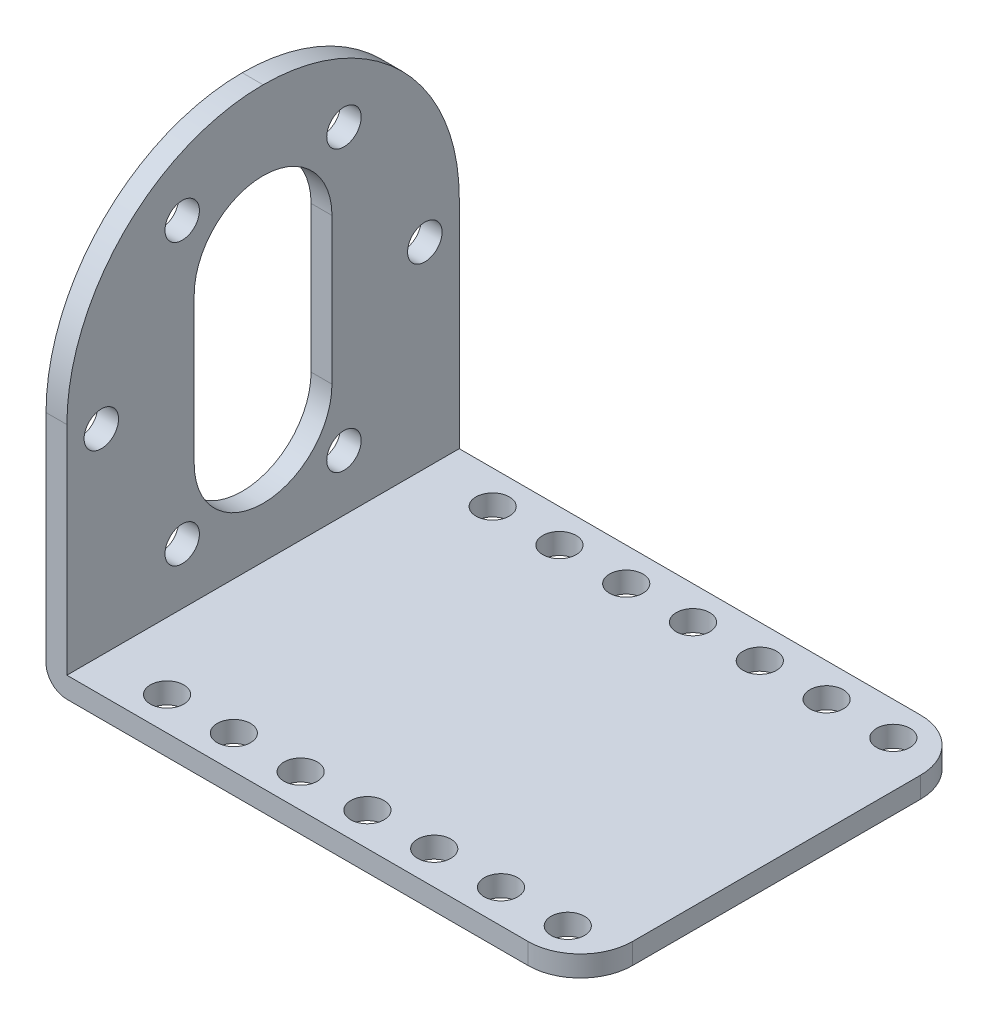
ISO-10303-21;
HEADER;
FILE_DESCRIPTION(('STEP AP214'),'2;1');
FILE_NAME('part.step','',(''),(''),'','','');
FILE_SCHEMA(('AUTOMOTIVE_DESIGN { 1 0 10303 214 1 1 1 1 }'));
ENDSEC;
DATA;
#1=APPLICATION_CONTEXT('core data for automotive mechanical design processes');
#2=APPLICATION_PROTOCOL_DEFINITION('international standard','automotive_design',2000,#1);
#3=PRODUCT_CONTEXT('',#1,'mechanical');
#4=PRODUCT('Part','Part','',(#3));
#5=PRODUCT_RELATED_PRODUCT_CATEGORY('part','',(#4));
#6=PRODUCT_DEFINITION_FORMATION('','',#4);
#7=PRODUCT_DEFINITION_CONTEXT('part definition',#1,'design');
#8=PRODUCT_DEFINITION('design','',#6,#7);
#9=PRODUCT_DEFINITION_SHAPE('','',#8);
#10=(LENGTH_UNIT() NAMED_UNIT(*) SI_UNIT(.MILLI.,.METRE.));
#11=(NAMED_UNIT(*) PLANE_ANGLE_UNIT() SI_UNIT($,.RADIAN.));
#12=(NAMED_UNIT(*) SI_UNIT($,.STERADIAN.) SOLID_ANGLE_UNIT());
#13=UNCERTAINTY_MEASURE_WITH_UNIT(LENGTH_MEASURE(1.E-05),#10,'distance_accuracy_value','');
#14=(GEOMETRIC_REPRESENTATION_CONTEXT(3) GLOBAL_UNCERTAINTY_ASSIGNED_CONTEXT((#13)) GLOBAL_UNIT_ASSIGNED_CONTEXT((#10,
#11,#12)) REPRESENTATION_CONTEXT('',''));
#15=CARTESIAN_POINT('',(0.,0.,0.));
#16=DIRECTION('',(0.,0.,1.));
#17=DIRECTION('',(1.,0.,0.));
#18=AXIS2_PLACEMENT_3D('',#15,#16,#17);
#19=CARTESIAN_POINT('',(0.,2.,0.));
#20=DIRECTION('',(0.,1.,0.));
#21=DIRECTION('',(0.,0.,1.));
#22=AXIS2_PLACEMENT_3D('',#19,#20,#21);
#23=PLANE('',#22);
#24=DIRECTION('',(0.,0.,-1.));
#25=VECTOR('',#24,1.);
#26=CARTESIAN_POINT('',(-23.6,2.,-18.8));
#27=LINE('',#26,#25);
#28=CARTESIAN_POINT('',(-23.6,2.,18.8));
#29=VERTEX_POINT('',#28);
#30=CARTESIAN_POINT('',(-23.6,2.,-18.8));
#31=VERTEX_POINT('',#30);
#32=EDGE_CURVE('E272',#29,#31,#27,.T.);
#33=ORIENTED_EDGE('',*,*,#32,.F.);
#34=DIRECTION('',(1.,0.,0.));
#35=VECTOR('',#34,1.);
#36=CARTESIAN_POINT('',(-25.6,2.,18.8));
#37=LINE('',#36,#35);
#38=CARTESIAN_POINT('',(20.6,2.,18.8));
#39=VERTEX_POINT('',#38);
#40=EDGE_CURVE('E325',#29,#39,#37,.T.);
#41=ORIENTED_EDGE('',*,*,#40,.T.);
#42=CARTESIAN_POINT('',(20.6,2.,13.8));
#43=DIRECTION('',(0.,1.,0.));
#44=DIRECTION('',(0.,0.,1.));
#45=AXIS2_PLACEMENT_3D('',#42,#43,#44);
#46=CIRCLE('',#45,5.);
#47=CARTESIAN_POINT('',(25.6,2.,13.8));
#48=VERTEX_POINT('',#47);
#49=EDGE_CURVE('E347',#39,#48,#46,.T.);
#50=ORIENTED_EDGE('',*,*,#49,.T.);
#51=DIRECTION('',(0.,0.,-1.));
#52=VECTOR('',#51,1.);
#53=CARTESIAN_POINT('',(25.6,2.,-18.8));
#54=LINE('',#53,#52);
#55=CARTESIAN_POINT('',(25.6,2.,-13.8));
#56=VERTEX_POINT('',#55);
#57=EDGE_CURVE('E362',#48,#56,#54,.T.);
#58=ORIENTED_EDGE('',*,*,#57,.T.);
#59=CARTESIAN_POINT('',(20.6,2.,-13.8));
#60=DIRECTION('',(0.,1.,0.));
#61=DIRECTION('',(0.,0.,1.));
#62=AXIS2_PLACEMENT_3D('',#59,#60,#61);
#63=CIRCLE('',#62,5.);
#64=CARTESIAN_POINT('',(20.6,2.,-18.8));
#65=VERTEX_POINT('',#64);
#66=EDGE_CURVE('E345',#56,#65,#63,.T.);
#67=ORIENTED_EDGE('',*,*,#66,.T.);
#68=DIRECTION('',(-1.,0.,0.));
#69=VECTOR('',#68,1.);
#70=CARTESIAN_POINT('',(-25.6,2.,-18.8));
#71=LINE('',#70,#69);
#72=EDGE_CURVE('E282',#65,#31,#71,.T.);
#73=ORIENTED_EDGE('',*,*,#72,.T.);
#74=EDGE_LOOP('',(#33,#41,#50,#58,#67,#73));
#75=FACE_BOUND('',#74,.T.);
#76=CARTESIAN_POINT('',(-10.8,2.,15.6));
#77=DIRECTION('',(0.,1.,0.));
#78=DIRECTION('',(0.,0.,-1.));
#79=AXIS2_PLACEMENT_3D('',#76,#77,#78);
#80=CIRCLE('',#79,1.6);
#81=CARTESIAN_POINT('',(-10.8,2.,14.));
#82=VERTEX_POINT('',#81);
#83=EDGE_CURVE('E438',#82,#82,#80,.T.);
#84=ORIENTED_EDGE('',*,*,#83,.F.);
#85=EDGE_LOOP('',(#84));
#86=FACE_BOUND('',#85,.T.);
#87=CARTESIAN_POINT('',(1.99999999999999,2.,15.6));
#88=DIRECTION('',(0.,1.,0.));
#89=DIRECTION('',(0.,0.,-1.));
#90=AXIS2_PLACEMENT_3D('',#87,#88,#89);
#91=CIRCLE('',#90,1.6);
#92=CARTESIAN_POINT('',(1.99999999999999,2.,14.));
#93=VERTEX_POINT('',#92);
#94=EDGE_CURVE('E426',#93,#93,#91,.T.);
#95=ORIENTED_EDGE('',*,*,#94,.F.);
#96=EDGE_LOOP('',(#95));
#97=FACE_BOUND('',#96,.T.);
#98=CARTESIAN_POINT('',(14.8,2.,15.6));
#99=DIRECTION('',(0.,1.,0.));
#100=DIRECTION('',(0.,0.,-1.));
#101=AXIS2_PLACEMENT_3D('',#98,#99,#100);
#102=CIRCLE('',#101,1.6);
#103=CARTESIAN_POINT('',(14.8,2.,14.));
#104=VERTEX_POINT('',#103);
#105=EDGE_CURVE('E414',#104,#104,#102,.T.);
#106=ORIENTED_EDGE('',*,*,#105,.F.);
#107=EDGE_LOOP('',(#106));
#108=FACE_BOUND('',#107,.T.);
#109=CARTESIAN_POINT('',(21.2,2.,-15.6));
#110=DIRECTION('',(0.,1.,0.));
#111=DIRECTION('',(0.,0.,1.));
#112=AXIS2_PLACEMENT_3D('',#109,#110,#111);
#113=CIRCLE('',#112,1.6);
#114=CARTESIAN_POINT('',(21.2,2.,-14.));
#115=VERTEX_POINT('',#114);
#116=EDGE_CURVE('E402',#115,#115,#113,.T.);
#117=ORIENTED_EDGE('',*,*,#116,.F.);
#118=EDGE_LOOP('',(#117));
#119=FACE_BOUND('',#118,.T.);
#120=CARTESIAN_POINT('',(8.4,2.,-15.6));
#121=DIRECTION('',(0.,1.,0.));
#122=DIRECTION('',(0.,0.,1.));
#123=AXIS2_PLACEMENT_3D('',#120,#121,#122);
#124=CIRCLE('',#123,1.6);
#125=CARTESIAN_POINT('',(8.4,2.,-14.));
#126=VERTEX_POINT('',#125);
#127=EDGE_CURVE('E390',#126,#126,#124,.T.);
#128=ORIENTED_EDGE('',*,*,#127,.F.);
#129=EDGE_LOOP('',(#128));
#130=FACE_BOUND('',#129,.T.);
#131=CARTESIAN_POINT('',(-4.4,2.,-15.6));
#132=DIRECTION('',(0.,1.,0.));
#133=DIRECTION('',(0.,0.,1.));
#134=AXIS2_PLACEMENT_3D('',#131,#132,#133);
#135=CIRCLE('',#134,1.6);
#136=CARTESIAN_POINT('',(-4.4,2.,-14.));
#137=VERTEX_POINT('',#136);
#138=EDGE_CURVE('E378',#137,#137,#135,.T.);
#139=ORIENTED_EDGE('',*,*,#138,.F.);
#140=EDGE_LOOP('',(#139));
#141=FACE_BOUND('',#140,.T.);
#142=CARTESIAN_POINT('',(-17.2,2.,-15.6));
#143=DIRECTION('',(0.,1.,0.));
#144=DIRECTION('',(0.,0.,1.));
#145=AXIS2_PLACEMENT_3D('',#142,#143,#144);
#146=CIRCLE('',#145,1.6);
#147=CARTESIAN_POINT('',(-17.2,2.,-14.));
#148=VERTEX_POINT('',#147);
#149=EDGE_CURVE('E360',#148,#148,#146,.T.);
#150=ORIENTED_EDGE('',*,*,#149,.F.);
#151=EDGE_LOOP('',(#150));
#152=FACE_BOUND('',#151,.T.);
#153=CARTESIAN_POINT('',(-10.8,2.,-15.6));
#154=DIRECTION('',(0.,1.,0.));
#155=DIRECTION('',(0.,0.,1.));
#156=AXIS2_PLACEMENT_3D('',#153,#154,#155);
#157=CIRCLE('',#156,1.6);
#158=CARTESIAN_POINT('',(-10.8,2.,-14.));
#159=VERTEX_POINT('',#158);
#160=EDGE_CURVE('E372',#159,#159,#157,.T.);
#161=ORIENTED_EDGE('',*,*,#160,.F.);
#162=EDGE_LOOP('',(#161));
#163=FACE_BOUND('',#162,.T.);
#164=CARTESIAN_POINT('',(1.99999999999999,2.,-15.6));
#165=DIRECTION('',(0.,1.,0.));
#166=DIRECTION('',(0.,0.,1.));
#167=AXIS2_PLACEMENT_3D('',#164,#165,#166);
#168=CIRCLE('',#167,1.6);
#169=CARTESIAN_POINT('',(1.99999999999999,2.,-14.));
#170=VERTEX_POINT('',#169);
#171=EDGE_CURVE('E384',#170,#170,#168,.T.);
#172=ORIENTED_EDGE('',*,*,#171,.F.);
#173=EDGE_LOOP('',(#172));
#174=FACE_BOUND('',#173,.T.);
#175=CARTESIAN_POINT('',(14.8,2.,-15.6));
#176=DIRECTION('',(0.,1.,0.));
#177=DIRECTION('',(0.,0.,1.));
#178=AXIS2_PLACEMENT_3D('',#175,#176,#177);
#179=CIRCLE('',#178,1.6);
#180=CARTESIAN_POINT('',(14.8,2.,-14.));
#181=VERTEX_POINT('',#180);
#182=EDGE_CURVE('E396',#181,#181,#179,.T.);
#183=ORIENTED_EDGE('',*,*,#182,.F.);
#184=EDGE_LOOP('',(#183));
#185=FACE_BOUND('',#184,.T.);
#186=CARTESIAN_POINT('',(21.2,2.,15.6));
#187=DIRECTION('',(0.,1.,0.));
#188=DIRECTION('',(0.,0.,-1.));
#189=AXIS2_PLACEMENT_3D('',#186,#187,#188);
#190=CIRCLE('',#189,1.6);
#191=CARTESIAN_POINT('',(21.2,2.,14.));
#192=VERTEX_POINT('',#191);
#193=EDGE_CURVE('E408',#192,#192,#190,.T.);
#194=ORIENTED_EDGE('',*,*,#193,.F.);
#195=EDGE_LOOP('',(#194));
#196=FACE_BOUND('',#195,.T.);
#197=CARTESIAN_POINT('',(8.4,2.,15.6));
#198=DIRECTION('',(0.,1.,0.));
#199=DIRECTION('',(0.,0.,-1.));
#200=AXIS2_PLACEMENT_3D('',#197,#198,#199);
#201=CIRCLE('',#200,1.6);
#202=CARTESIAN_POINT('',(8.4,2.,14.));
#203=VERTEX_POINT('',#202);
#204=EDGE_CURVE('E420',#203,#203,#201,.T.);
#205=ORIENTED_EDGE('',*,*,#204,.F.);
#206=EDGE_LOOP('',(#205));
#207=FACE_BOUND('',#206,.T.);
#208=CARTESIAN_POINT('',(-4.4,2.,15.6));
#209=DIRECTION('',(0.,1.,0.));
#210=DIRECTION('',(0.,0.,-1.));
#211=AXIS2_PLACEMENT_3D('',#208,#209,#210);
#212=CIRCLE('',#211,1.6);
#213=CARTESIAN_POINT('',(-4.4,2.,14.));
#214=VERTEX_POINT('',#213);
#215=EDGE_CURVE('E432',#214,#214,#212,.T.);
#216=ORIENTED_EDGE('',*,*,#215,.F.);
#217=EDGE_LOOP('',(#216));
#218=FACE_BOUND('',#217,.T.);
#219=CARTESIAN_POINT('',(-17.2,2.,15.6));
#220=DIRECTION('',(0.,1.,0.));
#221=DIRECTION('',(0.,0.,-1.));
#222=AXIS2_PLACEMENT_3D('',#219,#220,#221);
#223=CIRCLE('',#222,1.6);
#224=CARTESIAN_POINT('',(-17.2,2.,14.));
#225=VERTEX_POINT('',#224);
#226=EDGE_CURVE('E275',#225,#225,#223,.T.);
#227=ORIENTED_EDGE('',*,*,#226,.F.);
#228=EDGE_LOOP('',(#227));
#229=FACE_BOUND('',#228,.T.);
#230=ADVANCED_FACE('F93',(#75,#86,#97,#108,#119,#130,#141,#152,#163,#174,#185,#196,#207,#218,
#229),#23,.T.);
#231=CARTESIAN_POINT('',(0.,0.,0.));
#232=DIRECTION('',(0.,1.,0.));
#233=DIRECTION('',(0.,0.,1.));
#234=AXIS2_PLACEMENT_3D('',#231,#232,#233);
#235=PLANE('',#234);
#236=CARTESIAN_POINT('',(-10.8,0.,15.6));
#237=DIRECTION('',(0.,1.,0.));
#238=DIRECTION('',(0.,0.,-1.));
#239=AXIS2_PLACEMENT_3D('',#236,#237,#238);
#240=CIRCLE('',#239,1.6);
#241=CARTESIAN_POINT('',(-10.8,0.,14.));
#242=VERTEX_POINT('',#241);
#243=EDGE_CURVE('E441',#242,#242,#240,.T.);
#244=ORIENTED_EDGE('',*,*,#243,.T.);
#245=EDGE_LOOP('',(#244));
#246=FACE_BOUND('',#245,.T.);
#247=CARTESIAN_POINT('',(1.99999999999999,0.,15.6));
#248=DIRECTION('',(0.,1.,0.));
#249=DIRECTION('',(0.,0.,-1.));
#250=AXIS2_PLACEMENT_3D('',#247,#248,#249);
#251=CIRCLE('',#250,1.6);
#252=CARTESIAN_POINT('',(1.99999999999999,0.,14.));
#253=VERTEX_POINT('',#252);
#254=EDGE_CURVE('E429',#253,#253,#251,.T.);
#255=ORIENTED_EDGE('',*,*,#254,.T.);
#256=EDGE_LOOP('',(#255));
#257=FACE_BOUND('',#256,.T.);
#258=CARTESIAN_POINT('',(14.8,0.,15.6));
#259=DIRECTION('',(0.,1.,0.));
#260=DIRECTION('',(0.,0.,-1.));
#261=AXIS2_PLACEMENT_3D('',#258,#259,#260);
#262=CIRCLE('',#261,1.6);
#263=CARTESIAN_POINT('',(14.8,0.,14.));
#264=VERTEX_POINT('',#263);
#265=EDGE_CURVE('E417',#264,#264,#262,.T.);
#266=ORIENTED_EDGE('',*,*,#265,.T.);
#267=EDGE_LOOP('',(#266));
#268=FACE_BOUND('',#267,.T.);
#269=CARTESIAN_POINT('',(21.2,0.,-15.6));
#270=DIRECTION('',(0.,1.,0.));
#271=DIRECTION('',(0.,0.,1.));
#272=AXIS2_PLACEMENT_3D('',#269,#270,#271);
#273=CIRCLE('',#272,1.6);
#274=CARTESIAN_POINT('',(21.2,0.,-14.));
#275=VERTEX_POINT('',#274);
#276=EDGE_CURVE('E405',#275,#275,#273,.T.);
#277=ORIENTED_EDGE('',*,*,#276,.T.);
#278=EDGE_LOOP('',(#277));
#279=FACE_BOUND('',#278,.T.);
#280=CARTESIAN_POINT('',(8.4,0.,-15.6));
#281=DIRECTION('',(0.,1.,0.));
#282=DIRECTION('',(0.,0.,1.));
#283=AXIS2_PLACEMENT_3D('',#280,#281,#282);
#284=CIRCLE('',#283,1.6);
#285=CARTESIAN_POINT('',(8.4,0.,-14.));
#286=VERTEX_POINT('',#285);
#287=EDGE_CURVE('E393',#286,#286,#284,.T.);
#288=ORIENTED_EDGE('',*,*,#287,.T.);
#289=EDGE_LOOP('',(#288));
#290=FACE_BOUND('',#289,.T.);
#291=CARTESIAN_POINT('',(-4.4,0.,-15.6));
#292=DIRECTION('',(0.,1.,0.));
#293=DIRECTION('',(0.,0.,1.));
#294=AXIS2_PLACEMENT_3D('',#291,#292,#293);
#295=CIRCLE('',#294,1.6);
#296=CARTESIAN_POINT('',(-4.4,0.,-14.));
#297=VERTEX_POINT('',#296);
#298=EDGE_CURVE('E381',#297,#297,#295,.T.);
#299=ORIENTED_EDGE('',*,*,#298,.T.);
#300=EDGE_LOOP('',(#299));
#301=FACE_BOUND('',#300,.T.);
#302=CARTESIAN_POINT('',(-17.2,0.,-15.6));
#303=DIRECTION('',(0.,1.,0.));
#304=DIRECTION('',(0.,0.,1.));
#305=AXIS2_PLACEMENT_3D('',#302,#303,#304);
#306=CIRCLE('',#305,1.6);
#307=CARTESIAN_POINT('',(-17.2,0.,-14.));
#308=VERTEX_POINT('',#307);
#309=EDGE_CURVE('E369',#308,#308,#306,.T.);
#310=ORIENTED_EDGE('',*,*,#309,.T.);
#311=EDGE_LOOP('',(#310));
#312=FACE_BOUND('',#311,.T.);
#313=DIRECTION('',(1.,0.,0.));
#314=VECTOR('',#313,1.);
#315=CARTESIAN_POINT('',(-25.6,0.,18.8));
#316=LINE('',#315,#314);
#317=CARTESIAN_POINT('',(-23.6,0.,18.8));
#318=VERTEX_POINT('',#317);
#319=CARTESIAN_POINT('',(20.6,0.,18.8));
#320=VERTEX_POINT('',#319);
#321=EDGE_CURVE('E330',#318,#320,#316,.T.);
#322=ORIENTED_EDGE('',*,*,#321,.F.);
#323=DIRECTION('',(0.,0.,1.));
#324=VECTOR('',#323,1.);
#325=CARTESIAN_POINT('',(-23.6,0.,0.));
#326=LINE('',#325,#324);
#327=CARTESIAN_POINT('',(-23.6,0.,-18.8));
#328=VERTEX_POINT('',#327);
#329=EDGE_CURVE('E101',#318,#328,#326,.F.);
#330=ORIENTED_EDGE('',*,*,#329,.T.);
#331=DIRECTION('',(-1.,0.,0.));
#332=VECTOR('',#331,1.);
#333=CARTESIAN_POINT('',(-25.6,0.,-18.8));
#334=LINE('',#333,#332);
#335=CARTESIAN_POINT('',(20.6,0.,-18.8));
#336=VERTEX_POINT('',#335);
#337=EDGE_CURVE('E359',#336,#328,#334,.T.);
#338=ORIENTED_EDGE('',*,*,#337,.F.);
#339=CARTESIAN_POINT('',(20.6,0.,-13.8));
#340=DIRECTION('',(0.,1.,0.));
#341=DIRECTION('',(0.,0.,1.));
#342=AXIS2_PLACEMENT_3D('',#339,#340,#341);
#343=CIRCLE('',#342,5.);
#344=CARTESIAN_POINT('',(25.6,0.,-13.8));
#345=VERTEX_POINT('',#344);
#346=EDGE_CURVE('E337',#336,#345,#343,.F.);
#347=ORIENTED_EDGE('',*,*,#346,.T.);
#348=DIRECTION('',(0.,0.,-1.));
#349=VECTOR('',#348,1.);
#350=CARTESIAN_POINT('',(25.6,0.,-18.8));
#351=LINE('',#350,#349);
#352=CARTESIAN_POINT('',(25.6,0.,13.8));
#353=VERTEX_POINT('',#352);
#354=EDGE_CURVE('E357',#353,#345,#351,.T.);
#355=ORIENTED_EDGE('',*,*,#354,.F.);
#356=CARTESIAN_POINT('',(20.6,0.,13.8));
#357=DIRECTION('',(0.,1.,0.));
#358=DIRECTION('',(0.,0.,1.));
#359=AXIS2_PLACEMENT_3D('',#356,#357,#358);
#360=CIRCLE('',#359,5.);
#361=EDGE_CURVE('E339',#353,#320,#360,.F.);
#362=ORIENTED_EDGE('',*,*,#361,.T.);
#363=EDGE_LOOP('',(#322,#330,#338,#347,#355,#362));
#364=FACE_BOUND('',#363,.T.);
#365=CARTESIAN_POINT('',(-10.8,0.,-15.6));
#366=DIRECTION('',(0.,1.,0.));
#367=DIRECTION('',(0.,0.,1.));
#368=AXIS2_PLACEMENT_3D('',#365,#366,#367);
#369=CIRCLE('',#368,1.6);
#370=CARTESIAN_POINT('',(-10.8,0.,-14.));
#371=VERTEX_POINT('',#370);
#372=EDGE_CURVE('E375',#371,#371,#369,.T.);
#373=ORIENTED_EDGE('',*,*,#372,.T.);
#374=EDGE_LOOP('',(#373));
#375=FACE_BOUND('',#374,.T.);
#376=CARTESIAN_POINT('',(1.99999999999999,0.,-15.6));
#377=DIRECTION('',(0.,1.,0.));
#378=DIRECTION('',(0.,0.,1.));
#379=AXIS2_PLACEMENT_3D('',#376,#377,#378);
#380=CIRCLE('',#379,1.6);
#381=CARTESIAN_POINT('',(1.99999999999999,0.,-14.));
#382=VERTEX_POINT('',#381);
#383=EDGE_CURVE('E387',#382,#382,#380,.T.);
#384=ORIENTED_EDGE('',*,*,#383,.T.);
#385=EDGE_LOOP('',(#384));
#386=FACE_BOUND('',#385,.T.);
#387=CARTESIAN_POINT('',(14.8,0.,-15.6));
#388=DIRECTION('',(0.,1.,0.));
#389=DIRECTION('',(0.,0.,1.));
#390=AXIS2_PLACEMENT_3D('',#387,#388,#389);
#391=CIRCLE('',#390,1.6);
#392=CARTESIAN_POINT('',(14.8,0.,-14.));
#393=VERTEX_POINT('',#392);
#394=EDGE_CURVE('E399',#393,#393,#391,.T.);
#395=ORIENTED_EDGE('',*,*,#394,.T.);
#396=EDGE_LOOP('',(#395));
#397=FACE_BOUND('',#396,.T.);
#398=CARTESIAN_POINT('',(21.2,0.,15.6));
#399=DIRECTION('',(0.,1.,0.));
#400=DIRECTION('',(0.,0.,-1.));
#401=AXIS2_PLACEMENT_3D('',#398,#399,#400);
#402=CIRCLE('',#401,1.6);
#403=CARTESIAN_POINT('',(21.2,0.,14.));
#404=VERTEX_POINT('',#403);
#405=EDGE_CURVE('E411',#404,#404,#402,.T.);
#406=ORIENTED_EDGE('',*,*,#405,.T.);
#407=EDGE_LOOP('',(#406));
#408=FACE_BOUND('',#407,.T.);
#409=CARTESIAN_POINT('',(8.4,0.,15.6));
#410=DIRECTION('',(0.,1.,0.));
#411=DIRECTION('',(0.,0.,-1.));
#412=AXIS2_PLACEMENT_3D('',#409,#410,#411);
#413=CIRCLE('',#412,1.6);
#414=CARTESIAN_POINT('',(8.4,0.,14.));
#415=VERTEX_POINT('',#414);
#416=EDGE_CURVE('E423',#415,#415,#413,.T.);
#417=ORIENTED_EDGE('',*,*,#416,.T.);
#418=EDGE_LOOP('',(#417));
#419=FACE_BOUND('',#418,.T.);
#420=CARTESIAN_POINT('',(-4.4,0.,15.6));
#421=DIRECTION('',(0.,1.,0.));
#422=DIRECTION('',(0.,0.,-1.));
#423=AXIS2_PLACEMENT_3D('',#420,#421,#422);
#424=CIRCLE('',#423,1.6);
#425=CARTESIAN_POINT('',(-4.4,0.,14.));
#426=VERTEX_POINT('',#425);
#427=EDGE_CURVE('E435',#426,#426,#424,.T.);
#428=ORIENTED_EDGE('',*,*,#427,.T.);
#429=EDGE_LOOP('',(#428));
#430=FACE_BOUND('',#429,.T.);
#431=CARTESIAN_POINT('',(-17.2,0.,15.6));
#432=DIRECTION('',(0.,1.,0.));
#433=DIRECTION('',(0.,0.,-1.));
#434=AXIS2_PLACEMENT_3D('',#431,#432,#433);
#435=CIRCLE('',#434,1.6);
#436=CARTESIAN_POINT('',(-17.2,0.,14.));
#437=VERTEX_POINT('',#436);
#438=EDGE_CURVE('E299',#437,#437,#435,.T.);
#439=ORIENTED_EDGE('',*,*,#438,.T.);
#440=EDGE_LOOP('',(#439));
#441=FACE_BOUND('',#440,.T.);
#442=ADVANCED_FACE('F455',(#246,#257,#268,#279,#290,#301,#312,#364,#375,#386,#397,#408,#419,
#430,#441),#235,.F.);
#443=CARTESIAN_POINT('',(25.6,2.,-18.8));
#444=DIRECTION('',(-1.,0.,0.));
#445=DIRECTION('',(0.,0.,1.));
#446=AXIS2_PLACEMENT_3D('',#443,#444,#445);
#447=PLANE('',#446);
#448=ORIENTED_EDGE('',*,*,#57,.F.);
#449=DIRECTION('',(0.,-1.,0.));
#450=VECTOR('',#449,1.);
#451=CARTESIAN_POINT('',(25.6,2.,13.8));
#452=LINE('',#451,#450);
#453=EDGE_CURVE('E334',#48,#353,#452,.T.);
#454=ORIENTED_EDGE('',*,*,#453,.T.);
#455=ORIENTED_EDGE('',*,*,#354,.T.);
#456=DIRECTION('',(0.,-1.,0.));
#457=VECTOR('',#456,1.);
#458=CARTESIAN_POINT('',(25.6,2.,-13.8));
#459=LINE('',#458,#457);
#460=EDGE_CURVE('E327',#345,#56,#459,.F.);
#461=ORIENTED_EDGE('',*,*,#460,.T.);
#462=EDGE_LOOP('',(#448,#454,#455,#461));
#463=FACE_BOUND('',#462,.T.);
#464=ADVANCED_FACE('F460',(#463),#447,.F.);
#465=CARTESIAN_POINT('',(-25.6,2.,-18.8));
#466=DIRECTION('',(0.,0.,1.));
#467=DIRECTION('',(1.,0.,0.));
#468=AXIS2_PLACEMENT_3D('',#465,#466,#467);
#469=PLANE('',#468);
#470=ORIENTED_EDGE('',*,*,#337,.T.);
#471=CARTESIAN_POINT('',(-23.6,2.,-18.8));
#472=DIRECTION('',(0.,0.,1.));
#473=DIRECTION('',(1.,0.,0.));
#474=AXIS2_PLACEMENT_3D('',#471,#472,#473);
#475=CIRCLE('',#474,2.);
#476=CARTESIAN_POINT('',(-25.6,2.,-18.8));
#477=VERTEX_POINT('',#476);
#478=EDGE_CURVE('E12',#328,#477,#475,.F.);
#479=ORIENTED_EDGE('',*,*,#478,.T.);
#480=DIRECTION('',(0.,-1.,0.));
#481=VECTOR('',#480,1.);
#482=CARTESIAN_POINT('',(-25.6,2.,-18.8));
#483=LINE('',#482,#481);
#484=CARTESIAN_POINT('',(-25.6,22.8,-18.8));
#485=VERTEX_POINT('',#484);
#486=EDGE_CURVE('E319',#485,#477,#483,.T.);
#487=ORIENTED_EDGE('',*,*,#486,.F.);
#488=DIRECTION('',(-1.,0.,0.));
#489=VECTOR('',#488,1.);
#490=CARTESIAN_POINT('',(-23.6,22.8,-18.8));
#491=LINE('',#490,#489);
#492=CARTESIAN_POINT('',(-23.6,22.8,-18.8));
#493=VERTEX_POINT('',#492);
#494=EDGE_CURVE('E294',#485,#493,#491,.F.);
#495=ORIENTED_EDGE('',*,*,#494,.T.);
#496=DIRECTION('',(0.,-1.,0.));
#497=VECTOR('',#496,1.);
#498=CARTESIAN_POINT('',(-23.6,41.6,-18.8));
#499=LINE('',#498,#497);
#500=EDGE_CURVE('E281',#493,#31,#499,.T.);
#501=ORIENTED_EDGE('',*,*,#500,.T.);
#502=ORIENTED_EDGE('',*,*,#72,.F.);
#503=DIRECTION('',(0.,-1.,0.));
#504=VECTOR('',#503,1.);
#505=CARTESIAN_POINT('',(20.6,2.,-18.8));
#506=LINE('',#505,#504);
#507=EDGE_CURVE('E349',#65,#336,#506,.T.);
#508=ORIENTED_EDGE('',*,*,#507,.T.);
#509=EDGE_LOOP('',(#470,#479,#487,#495,#501,#502,#508));
#510=FACE_BOUND('',#509,.T.);
#511=ADVANCED_FACE('F473',(#510),#469,.F.);
#512=CARTESIAN_POINT('',(-25.6,2.,-18.8));
#513=DIRECTION('',(1.,0.,0.));
#514=DIRECTION('',(0.,0.,-1.));
#515=AXIS2_PLACEMENT_3D('',#512,#513,#514);
#516=PLANE('',#515);
#517=CARTESIAN_POINT('',(-25.6,13.4561216649354,0.));
#518=DIRECTION('',(-1.,0.,0.));
#519=DIRECTION('',(0.,0.,1.));
#520=AXIS2_PLACEMENT_3D('',#517,#518,#519);
#521=CIRCLE('',#520,6.6);
#522=CARTESIAN_POINT('',(-25.6,13.4561216649354,-6.6));
#523=VERTEX_POINT('',#522);
#524=CARTESIAN_POINT('',(-25.6,13.4561216649354,6.60000000000001));
#525=VERTEX_POINT('',#524);
#526=EDGE_CURVE('E221',#523,#525,#521,.T.);
#527=ORIENTED_EDGE('',*,*,#526,.F.);
#528=DIRECTION('',(0.,-1.,0.));
#529=VECTOR('',#528,1.);
#530=CARTESIAN_POINT('',(-25.6,0.,-6.59999999999999));
#531=LINE('',#530,#529);
#532=CARTESIAN_POINT('',(-25.6,27.4561216649354,-6.6));
#533=VERTEX_POINT('',#532);
#534=EDGE_CURVE('E200',#533,#523,#531,.T.);
#535=ORIENTED_EDGE('',*,*,#534,.F.);
#536=CARTESIAN_POINT('',(-25.6,27.4561216649354,0.));
#537=DIRECTION('',(-1.,0.,0.));
#538=DIRECTION('',(0.,0.,1.));
#539=AXIS2_PLACEMENT_3D('',#536,#537,#538);
#540=CIRCLE('',#539,6.6);
#541=CARTESIAN_POINT('',(-25.6,27.4561216649354,6.6));
#542=VERTEX_POINT('',#541);
#543=EDGE_CURVE('E205',#542,#533,#540,.T.);
#544=ORIENTED_EDGE('',*,*,#543,.F.);
#545=DIRECTION('',(0.,-1.,0.));
#546=VECTOR('',#545,1.);
#547=CARTESIAN_POINT('',(-25.6,0.,6.60000000000001));
#548=LINE('',#547,#546);
#549=EDGE_CURVE('E228',#542,#525,#548,.T.);
#550=ORIENTED_EDGE('',*,*,#549,.T.);
#551=EDGE_LOOP('',(#527,#535,#544,#550));
#552=FACE_BOUND('',#551,.T.);
#553=CARTESIAN_POINT('',(-25.6,34.2233937586589,-7.74999999999987));
#554=DIRECTION('',(-1.,0.,0.));
#555=DIRECTION('',(0.,0.,1.));
#556=AXIS2_PLACEMENT_3D('',#553,#554,#555);
#557=CIRCLE('',#556,1.65);
#558=CARTESIAN_POINT('',(-25.6,34.2233937586589,-6.09999999999987));
#559=VERTEX_POINT('',#558);
#560=EDGE_CURVE('E213',#559,#559,#557,.T.);
#561=ORIENTED_EDGE('',*,*,#560,.F.);
#562=EDGE_LOOP('',(#561));
#563=FACE_BOUND('',#562,.T.);
#564=CARTESIAN_POINT('',(-25.6,20.8000000000001,-15.5));
#565=DIRECTION('',(-1.,0.,0.));
#566=DIRECTION('',(0.,0.,1.));
#567=AXIS2_PLACEMENT_3D('',#564,#565,#566);
#568=CIRCLE('',#567,1.65);
#569=CARTESIAN_POINT('',(-25.6,20.8000000000001,-13.85));
#570=VERTEX_POINT('',#569);
#571=EDGE_CURVE('E242',#570,#570,#568,.T.);
#572=ORIENTED_EDGE('',*,*,#571,.F.);
#573=EDGE_LOOP('',(#572));
#574=FACE_BOUND('',#573,.T.);
#575=CARTESIAN_POINT('',(-25.6,7.37660624134124,-7.75000000000006));
#576=DIRECTION('',(-1.,0.,0.));
#577=DIRECTION('',(0.,0.,1.));
#578=AXIS2_PLACEMENT_3D('',#575,#576,#577);
#579=CIRCLE('',#578,1.65);
#580=CARTESIAN_POINT('',(-25.6,7.37660624134124,-6.10000000000006));
#581=VERTEX_POINT('',#580);
#582=EDGE_CURVE('E248',#581,#581,#579,.T.);
#583=ORIENTED_EDGE('',*,*,#582,.F.);
#584=EDGE_LOOP('',(#583));
#585=FACE_BOUND('',#584,.T.);
#586=CARTESIAN_POINT('',(-25.6,7.37660624134119,7.74999999999997));
#587=DIRECTION('',(-1.,0.,0.));
#588=DIRECTION('',(0.,0.,1.));
#589=AXIS2_PLACEMENT_3D('',#586,#587,#588);
#590=CIRCLE('',#589,1.65);
#591=CARTESIAN_POINT('',(-25.6,7.37660624134119,9.39999999999996));
#592=VERTEX_POINT('',#591);
#593=EDGE_CURVE('E254',#592,#592,#590,.T.);
#594=ORIENTED_EDGE('',*,*,#593,.F.);
#595=EDGE_LOOP('',(#594));
#596=FACE_BOUND('',#595,.T.);
#597=CARTESIAN_POINT('',(-25.6,20.8,15.5));
#598=DIRECTION('',(-1.,0.,0.));
#599=DIRECTION('',(0.,0.,1.));
#600=AXIS2_PLACEMENT_3D('',#597,#598,#599);
#601=CIRCLE('',#600,1.65);
#602=CARTESIAN_POINT('',(-25.6,20.8,17.15));
#603=VERTEX_POINT('',#602);
#604=EDGE_CURVE('E260',#603,#603,#601,.T.);
#605=ORIENTED_EDGE('',*,*,#604,.F.);
#606=EDGE_LOOP('',(#605));
#607=FACE_BOUND('',#606,.T.);
#608=CARTESIAN_POINT('',(-25.6,34.2233937586587,7.75000000000016));
#609=DIRECTION('',(-1.,0.,0.));
#610=DIRECTION('',(0.,0.,1.));
#611=AXIS2_PLACEMENT_3D('',#608,#609,#610);
#612=CIRCLE('',#611,1.65);
#613=CARTESIAN_POINT('',(-25.6,34.2233937586587,9.40000000000016));
#614=VERTEX_POINT('',#613);
#615=EDGE_CURVE('E266',#614,#614,#612,.T.);
#616=ORIENTED_EDGE('',*,*,#615,.F.);
#617=EDGE_LOOP('',(#616));
#618=FACE_BOUND('',#617,.T.);
#619=ORIENTED_EDGE('',*,*,#486,.T.);
#620=DIRECTION('',(0.,0.,1.));
#621=VECTOR('',#620,1.);
#622=CARTESIAN_POINT('',(-25.6,2.,-18.8));
#623=LINE('',#622,#621);
#624=CARTESIAN_POINT('',(-25.6,2.,18.8));
#625=VERTEX_POINT('',#624);
#626=EDGE_CURVE('E305',#477,#625,#623,.T.);
#627=ORIENTED_EDGE('',*,*,#626,.T.);
#628=DIRECTION('',(0.,-1.,0.));
#629=VECTOR('',#628,1.);
#630=CARTESIAN_POINT('',(-25.6,2.,18.8));
#631=LINE('',#630,#629);
#632=CARTESIAN_POINT('',(-25.6,22.8,18.8));
#633=VERTEX_POINT('',#632);
#634=EDGE_CURVE('E316',#633,#625,#631,.T.);
#635=ORIENTED_EDGE('',*,*,#634,.F.);
#636=CARTESIAN_POINT('',(-25.6,22.8,0.));
#637=DIRECTION('',(1.,0.,0.));
#638=DIRECTION('',(0.,0.,-1.));
#639=AXIS2_PLACEMENT_3D('',#636,#637,#638);
#640=CIRCLE('',#639,18.8);
#641=CARTESIAN_POINT('',(-25.6,41.6,0.));
#642=VERTEX_POINT('',#641);
#643=EDGE_CURVE('E351',#633,#642,#640,.F.);
#644=ORIENTED_EDGE('',*,*,#643,.T.);
#645=CARTESIAN_POINT('',(-25.6,22.8,0.));
#646=DIRECTION('',(1.,0.,0.));
#647=DIRECTION('',(0.,0.,-1.));
#648=AXIS2_PLACEMENT_3D('',#645,#646,#647);
#649=CIRCLE('',#648,18.8);
#650=EDGE_CURVE('E293',#642,#485,#649,.F.);
#651=ORIENTED_EDGE('',*,*,#650,.T.);
#652=EDGE_LOOP('',(#619,#627,#635,#644,#651));
#653=FACE_BOUND('',#652,.T.);
#654=ADVANCED_FACE('F315',(#552,#563,#574,#585,#596,#607,#618,#653),#516,.F.);
#655=CARTESIAN_POINT('',(-25.6,2.,18.8));
#656=DIRECTION('',(0.,0.,-1.));
#657=DIRECTION('',(-1.,0.,0.));
#658=AXIS2_PLACEMENT_3D('',#655,#656,#657);
#659=PLANE('',#658);
#660=ORIENTED_EDGE('',*,*,#634,.T.);
#661=CARTESIAN_POINT('',(-23.6,2.,18.8));
#662=DIRECTION('',(0.,0.,-1.));
#663=DIRECTION('',(-1.,0.,0.));
#664=AXIS2_PLACEMENT_3D('',#661,#662,#663);
#665=CIRCLE('',#664,2.);
#666=EDGE_CURVE('E115',#625,#318,#665,.F.);
#667=ORIENTED_EDGE('',*,*,#666,.T.);
#668=ORIENTED_EDGE('',*,*,#321,.T.);
#669=DIRECTION('',(0.,-1.,0.));
#670=VECTOR('',#669,1.);
#671=CARTESIAN_POINT('',(20.6,2.,18.8));
#672=LINE('',#671,#670);
#673=EDGE_CURVE('E342',#320,#39,#672,.F.);
#674=ORIENTED_EDGE('',*,*,#673,.T.);
#675=ORIENTED_EDGE('',*,*,#40,.F.);
#676=DIRECTION('',(0.,-1.,0.));
#677=VECTOR('',#676,1.);
#678=CARTESIAN_POINT('',(-23.6,41.6,18.8));
#679=LINE('',#678,#677);
#680=CARTESIAN_POINT('',(-23.6,22.8,18.8));
#681=VERTEX_POINT('',#680);
#682=EDGE_CURVE('E292',#681,#29,#679,.T.);
#683=ORIENTED_EDGE('',*,*,#682,.F.);
#684=DIRECTION('',(1.,0.,0.));
#685=VECTOR('',#684,1.);
#686=CARTESIAN_POINT('',(-25.6,22.8,18.8));
#687=LINE('',#686,#685);
#688=EDGE_CURVE('E303',#681,#633,#687,.F.);
#689=ORIENTED_EDGE('',*,*,#688,.T.);
#690=EDGE_LOOP('',(#660,#667,#668,#674,#675,#683,#689));
#691=FACE_BOUND('',#690,.T.);
#692=ADVANCED_FACE('F322',(#691),#659,.F.);
#693=CARTESIAN_POINT('',(-17.2,2.,-15.6));
#694=DIRECTION('',(0.,-1.,0.));
#695=DIRECTION('',(0.,0.,-1.));
#696=AXIS2_PLACEMENT_3D('',#693,#694,#695);
#697=CYLINDRICAL_SURFACE('',#696,1.6);
#698=ORIENTED_EDGE('',*,*,#149,.T.);
#699=EDGE_LOOP('',(#698));
#700=FACE_BOUND('',#699,.T.);
#701=ORIENTED_EDGE('',*,*,#309,.F.);
#702=EDGE_LOOP('',(#701));
#703=FACE_BOUND('',#702,.T.);
#704=ADVANCED_FACE('F466',(#700,#703),#697,.F.);
#705=CARTESIAN_POINT('',(-10.8,2.,-15.6));
#706=DIRECTION('',(0.,-1.,0.));
#707=DIRECTION('',(0.,0.,-1.));
#708=AXIS2_PLACEMENT_3D('',#705,#706,#707);
#709=CYLINDRICAL_SURFACE('',#708,1.6);
#710=ORIENTED_EDGE('',*,*,#160,.T.);
#711=EDGE_LOOP('',(#710));
#712=FACE_BOUND('',#711,.T.);
#713=ORIENTED_EDGE('',*,*,#372,.F.);
#714=EDGE_LOOP('',(#713));
#715=FACE_BOUND('',#714,.T.);
#716=ADVANCED_FACE('F563',(#712,#715),#709,.F.);
#717=CARTESIAN_POINT('',(-4.4,2.,-15.6));
#718=DIRECTION('',(0.,-1.,0.));
#719=DIRECTION('',(0.,0.,-1.));
#720=AXIS2_PLACEMENT_3D('',#717,#718,#719);
#721=CYLINDRICAL_SURFACE('',#720,1.6);
#722=ORIENTED_EDGE('',*,*,#138,.T.);
#723=EDGE_LOOP('',(#722));
#724=FACE_BOUND('',#723,.T.);
#725=ORIENTED_EDGE('',*,*,#298,.F.);
#726=EDGE_LOOP('',(#725));
#727=FACE_BOUND('',#726,.T.);
#728=ADVANCED_FACE('F570',(#724,#727),#721,.F.);
#729=CARTESIAN_POINT('',(1.99999999999999,2.,-15.6));
#730=DIRECTION('',(0.,-1.,0.));
#731=DIRECTION('',(0.,0.,-1.));
#732=AXIS2_PLACEMENT_3D('',#729,#730,#731);
#733=CYLINDRICAL_SURFACE('',#732,1.6);
#734=ORIENTED_EDGE('',*,*,#171,.T.);
#735=EDGE_LOOP('',(#734));
#736=FACE_BOUND('',#735,.T.);
#737=ORIENTED_EDGE('',*,*,#383,.F.);
#738=EDGE_LOOP('',(#737));
#739=FACE_BOUND('',#738,.T.);
#740=ADVANCED_FACE('F577',(#736,#739),#733,.F.);
#741=CARTESIAN_POINT('',(8.4,2.,-15.6));
#742=DIRECTION('',(0.,-1.,0.));
#743=DIRECTION('',(0.,0.,-1.));
#744=AXIS2_PLACEMENT_3D('',#741,#742,#743);
#745=CYLINDRICAL_SURFACE('',#744,1.6);
#746=ORIENTED_EDGE('',*,*,#127,.T.);
#747=EDGE_LOOP('',(#746));
#748=FACE_BOUND('',#747,.T.);
#749=ORIENTED_EDGE('',*,*,#287,.F.);
#750=EDGE_LOOP('',(#749));
#751=FACE_BOUND('',#750,.T.);
#752=ADVANCED_FACE('F585',(#748,#751),#745,.F.);
#753=CARTESIAN_POINT('',(14.8,2.,-15.6));
#754=DIRECTION('',(0.,-1.,0.));
#755=DIRECTION('',(0.,0.,-1.));
#756=AXIS2_PLACEMENT_3D('',#753,#754,#755);
#757=CYLINDRICAL_SURFACE('',#756,1.6);
#758=ORIENTED_EDGE('',*,*,#182,.T.);
#759=EDGE_LOOP('',(#758));
#760=FACE_BOUND('',#759,.T.);
#761=ORIENTED_EDGE('',*,*,#394,.F.);
#762=EDGE_LOOP('',(#761));
#763=FACE_BOUND('',#762,.T.);
#764=ADVANCED_FACE('F593',(#760,#763),#757,.F.);
#765=CARTESIAN_POINT('',(21.2,2.,-15.6));
#766=DIRECTION('',(0.,-1.,0.));
#767=DIRECTION('',(0.,0.,-1.));
#768=AXIS2_PLACEMENT_3D('',#765,#766,#767);
#769=CYLINDRICAL_SURFACE('',#768,1.6);
#770=ORIENTED_EDGE('',*,*,#116,.T.);
#771=EDGE_LOOP('',(#770));
#772=FACE_BOUND('',#771,.T.);
#773=ORIENTED_EDGE('',*,*,#276,.F.);
#774=EDGE_LOOP('',(#773));
#775=FACE_BOUND('',#774,.T.);
#776=ADVANCED_FACE('F601',(#772,#775),#769,.F.);
#777=CARTESIAN_POINT('',(21.2,2.,15.6));
#778=DIRECTION('',(0.,-1.,0.));
#779=DIRECTION('',(0.,0.,-1.));
#780=AXIS2_PLACEMENT_3D('',#777,#778,#779);
#781=CYLINDRICAL_SURFACE('',#780,1.6);
#782=ORIENTED_EDGE('',*,*,#193,.T.);
#783=EDGE_LOOP('',(#782));
#784=FACE_BOUND('',#783,.T.);
#785=ORIENTED_EDGE('',*,*,#405,.F.);
#786=EDGE_LOOP('',(#785));
#787=FACE_BOUND('',#786,.T.);
#788=ADVANCED_FACE('F609',(#784,#787),#781,.F.);
#789=CARTESIAN_POINT('',(14.8,2.,15.6));
#790=DIRECTION('',(0.,-1.,0.));
#791=DIRECTION('',(0.,0.,-1.));
#792=AXIS2_PLACEMENT_3D('',#789,#790,#791);
#793=CYLINDRICAL_SURFACE('',#792,1.6);
#794=ORIENTED_EDGE('',*,*,#105,.T.);
#795=EDGE_LOOP('',(#794));
#796=FACE_BOUND('',#795,.T.);
#797=ORIENTED_EDGE('',*,*,#265,.F.);
#798=EDGE_LOOP('',(#797));
#799=FACE_BOUND('',#798,.T.);
#800=ADVANCED_FACE('F617',(#796,#799),#793,.F.);
#801=CARTESIAN_POINT('',(8.4,2.,15.6));
#802=DIRECTION('',(0.,-1.,0.));
#803=DIRECTION('',(0.,0.,-1.));
#804=AXIS2_PLACEMENT_3D('',#801,#802,#803);
#805=CYLINDRICAL_SURFACE('',#804,1.6);
#806=ORIENTED_EDGE('',*,*,#204,.T.);
#807=EDGE_LOOP('',(#806));
#808=FACE_BOUND('',#807,.T.);
#809=ORIENTED_EDGE('',*,*,#416,.F.);
#810=EDGE_LOOP('',(#809));
#811=FACE_BOUND('',#810,.T.);
#812=ADVANCED_FACE('F625',(#808,#811),#805,.F.);
#813=CARTESIAN_POINT('',(1.99999999999999,2.,15.6));
#814=DIRECTION('',(0.,-1.,0.));
#815=DIRECTION('',(0.,0.,-1.));
#816=AXIS2_PLACEMENT_3D('',#813,#814,#815);
#817=CYLINDRICAL_SURFACE('',#816,1.6);
#818=ORIENTED_EDGE('',*,*,#94,.T.);
#819=EDGE_LOOP('',(#818));
#820=FACE_BOUND('',#819,.T.);
#821=ORIENTED_EDGE('',*,*,#254,.F.);
#822=EDGE_LOOP('',(#821));
#823=FACE_BOUND('',#822,.T.);
#824=ADVANCED_FACE('F633',(#820,#823),#817,.F.);
#825=CARTESIAN_POINT('',(-4.4,2.,15.6));
#826=DIRECTION('',(0.,-1.,0.));
#827=DIRECTION('',(0.,0.,-1.));
#828=AXIS2_PLACEMENT_3D('',#825,#826,#827);
#829=CYLINDRICAL_SURFACE('',#828,1.6);
#830=ORIENTED_EDGE('',*,*,#215,.T.);
#831=EDGE_LOOP('',(#830));
#832=FACE_BOUND('',#831,.T.);
#833=ORIENTED_EDGE('',*,*,#427,.F.);
#834=EDGE_LOOP('',(#833));
#835=FACE_BOUND('',#834,.T.);
#836=ADVANCED_FACE('F641',(#832,#835),#829,.F.);
#837=CARTESIAN_POINT('',(-10.8,2.,15.6));
#838=DIRECTION('',(0.,-1.,0.));
#839=DIRECTION('',(0.,0.,-1.));
#840=AXIS2_PLACEMENT_3D('',#837,#838,#839);
#841=CYLINDRICAL_SURFACE('',#840,1.6);
#842=ORIENTED_EDGE('',*,*,#83,.T.);
#843=EDGE_LOOP('',(#842));
#844=FACE_BOUND('',#843,.T.);
#845=ORIENTED_EDGE('',*,*,#243,.F.);
#846=EDGE_LOOP('',(#845));
#847=FACE_BOUND('',#846,.T.);
#848=ADVANCED_FACE('F649',(#844,#847),#841,.F.);
#849=CARTESIAN_POINT('',(-17.2,2.,15.6));
#850=DIRECTION('',(0.,-1.,0.));
#851=DIRECTION('',(0.,0.,-1.));
#852=AXIS2_PLACEMENT_3D('',#849,#850,#851);
#853=CYLINDRICAL_SURFACE('',#852,1.6);
#854=ORIENTED_EDGE('',*,*,#226,.T.);
#855=EDGE_LOOP('',(#854));
#856=FACE_BOUND('',#855,.T.);
#857=ORIENTED_EDGE('',*,*,#438,.F.);
#858=EDGE_LOOP('',(#857));
#859=FACE_BOUND('',#858,.T.);
#860=ADVANCED_FACE('F451',(#856,#859),#853,.F.);
#861=CARTESIAN_POINT('',(20.6,2.,13.8));
#862=DIRECTION('',(0.,-1.,0.));
#863=DIRECTION('',(0.,0.,-1.));
#864=AXIS2_PLACEMENT_3D('',#861,#862,#863);
#865=CYLINDRICAL_SURFACE('',#864,5.);
#866=ORIENTED_EDGE('',*,*,#49,.F.);
#867=ORIENTED_EDGE('',*,*,#673,.F.);
#868=ORIENTED_EDGE('',*,*,#361,.F.);
#869=ORIENTED_EDGE('',*,*,#453,.F.);
#870=EDGE_LOOP('',(#866,#867,#868,#869));
#871=FACE_BOUND('',#870,.T.);
#872=ADVANCED_FACE('F480',(#871),#865,.T.);
#873=CARTESIAN_POINT('',(20.6,2.,-13.8));
#874=DIRECTION('',(0.,-1.,0.));
#875=DIRECTION('',(0.,0.,-1.));
#876=AXIS2_PLACEMENT_3D('',#873,#874,#875);
#877=CYLINDRICAL_SURFACE('',#876,5.);
#878=ORIENTED_EDGE('',*,*,#66,.F.);
#879=ORIENTED_EDGE('',*,*,#460,.F.);
#880=ORIENTED_EDGE('',*,*,#346,.F.);
#881=ORIENTED_EDGE('',*,*,#507,.F.);
#882=EDGE_LOOP('',(#878,#879,#880,#881));
#883=FACE_BOUND('',#882,.T.);
#884=ADVANCED_FACE('F483',(#883),#877,.T.);
#885=CARTESIAN_POINT('',(-23.6,41.6,-18.8));
#886=DIRECTION('',(-1.,0.,0.));
#887=DIRECTION('',(0.,0.,1.));
#888=AXIS2_PLACEMENT_3D('',#885,#886,#887);
#889=PLANE('',#888);
#890=CARTESIAN_POINT('',(-23.6,27.4561216649354,0.));
#891=DIRECTION('',(-1.,0.,0.));
#892=DIRECTION('',(0.,0.,1.));
#893=AXIS2_PLACEMENT_3D('',#890,#891,#892);
#894=CIRCLE('',#893,6.6);
#895=CARTESIAN_POINT('',(-23.6,27.4561216649354,-6.6));
#896=VERTEX_POINT('',#895);
#897=CARTESIAN_POINT('',(-23.6,27.4561216649354,6.6));
#898=VERTEX_POINT('',#897);
#899=EDGE_CURVE('E219',#896,#898,#894,.F.);
#900=ORIENTED_EDGE('',*,*,#899,.F.);
#901=DIRECTION('',(0.,1.,0.));
#902=VECTOR('',#901,1.);
#903=CARTESIAN_POINT('',(-23.6,0.,-6.59999999999999));
#904=LINE('',#903,#902);
#905=CARTESIAN_POINT('',(-23.6,13.4561216649354,-6.6));
#906=VERTEX_POINT('',#905);
#907=EDGE_CURVE('E197',#906,#896,#904,.T.);
#908=ORIENTED_EDGE('',*,*,#907,.F.);
#909=CARTESIAN_POINT('',(-23.6,13.4561216649354,0.));
#910=DIRECTION('',(-1.,0.,0.));
#911=DIRECTION('',(0.,0.,1.));
#912=AXIS2_PLACEMENT_3D('',#909,#910,#911);
#913=CIRCLE('',#912,6.6);
#914=CARTESIAN_POINT('',(-23.6,13.4561216649354,6.6));
#915=VERTEX_POINT('',#914);
#916=EDGE_CURVE('E209',#915,#906,#913,.F.);
#917=ORIENTED_EDGE('',*,*,#916,.F.);
#918=DIRECTION('',(0.,1.,0.));
#919=VECTOR('',#918,1.);
#920=CARTESIAN_POINT('',(-23.6,0.,6.60000000000001));
#921=LINE('',#920,#919);
#922=EDGE_CURVE('E223',#915,#898,#921,.T.);
#923=ORIENTED_EDGE('',*,*,#922,.T.);
#924=EDGE_LOOP('',(#900,#908,#917,#923));
#925=FACE_BOUND('',#924,.T.);
#926=CARTESIAN_POINT('',(-23.6,34.2233937586589,-7.74999999999987));
#927=DIRECTION('',(-1.,0.,0.));
#928=DIRECTION('',(0.,0.,1.));
#929=AXIS2_PLACEMENT_3D('',#926,#927,#928);
#930=CIRCLE('',#929,1.65);
#931=CARTESIAN_POINT('',(-23.6,34.2233937586589,-6.09999999999987));
#932=VERTEX_POINT('',#931);
#933=EDGE_CURVE('E239',#932,#932,#930,.F.);
#934=ORIENTED_EDGE('',*,*,#933,.F.);
#935=EDGE_LOOP('',(#934));
#936=FACE_BOUND('',#935,.T.);
#937=CARTESIAN_POINT('',(-23.6,20.8000000000001,-15.5));
#938=DIRECTION('',(-1.,0.,0.));
#939=DIRECTION('',(0.,0.,1.));
#940=AXIS2_PLACEMENT_3D('',#937,#938,#939);
#941=CIRCLE('',#940,1.65);
#942=CARTESIAN_POINT('',(-23.6,20.8000000000001,-13.85));
#943=VERTEX_POINT('',#942);
#944=EDGE_CURVE('E245',#943,#943,#941,.F.);
#945=ORIENTED_EDGE('',*,*,#944,.F.);
#946=EDGE_LOOP('',(#945));
#947=FACE_BOUND('',#946,.T.);
#948=CARTESIAN_POINT('',(-23.6,7.37660624134124,-7.75000000000006));
#949=DIRECTION('',(-1.,0.,0.));
#950=DIRECTION('',(0.,0.,1.));
#951=AXIS2_PLACEMENT_3D('',#948,#949,#950);
#952=CIRCLE('',#951,1.65);
#953=CARTESIAN_POINT('',(-23.6,7.37660624134124,-6.10000000000006));
#954=VERTEX_POINT('',#953);
#955=EDGE_CURVE('E251',#954,#954,#952,.F.);
#956=ORIENTED_EDGE('',*,*,#955,.F.);
#957=EDGE_LOOP('',(#956));
#958=FACE_BOUND('',#957,.T.);
#959=CARTESIAN_POINT('',(-23.6,7.37660624134119,7.74999999999997));
#960=DIRECTION('',(-1.,0.,0.));
#961=DIRECTION('',(0.,0.,1.));
#962=AXIS2_PLACEMENT_3D('',#959,#960,#961);
#963=CIRCLE('',#962,1.65);
#964=CARTESIAN_POINT('',(-23.6,7.37660624134119,9.39999999999996));
#965=VERTEX_POINT('',#964);
#966=EDGE_CURVE('E257',#965,#965,#963,.F.);
#967=ORIENTED_EDGE('',*,*,#966,.F.);
#968=EDGE_LOOP('',(#967));
#969=FACE_BOUND('',#968,.T.);
#970=CARTESIAN_POINT('',(-23.6,20.8,15.5));
#971=DIRECTION('',(-1.,0.,0.));
#972=DIRECTION('',(0.,0.,1.));
#973=AXIS2_PLACEMENT_3D('',#970,#971,#972);
#974=CIRCLE('',#973,1.65);
#975=CARTESIAN_POINT('',(-23.6,20.8,17.15));
#976=VERTEX_POINT('',#975);
#977=EDGE_CURVE('E263',#976,#976,#974,.F.);
#978=ORIENTED_EDGE('',*,*,#977,.F.);
#979=EDGE_LOOP('',(#978));
#980=FACE_BOUND('',#979,.T.);
#981=CARTESIAN_POINT('',(-23.6,34.2233937586587,7.75000000000016));
#982=DIRECTION('',(-1.,0.,0.));
#983=DIRECTION('',(0.,0.,1.));
#984=AXIS2_PLACEMENT_3D('',#981,#982,#983);
#985=CIRCLE('',#984,1.65);
#986=CARTESIAN_POINT('',(-23.6,34.2233937586587,9.40000000000016));
#987=VERTEX_POINT('',#986);
#988=EDGE_CURVE('E269',#987,#987,#985,.F.);
#989=ORIENTED_EDGE('',*,*,#988,.F.);
#990=EDGE_LOOP('',(#989));
#991=FACE_BOUND('',#990,.T.);
#992=ORIENTED_EDGE('',*,*,#500,.F.);
#993=CARTESIAN_POINT('',(-23.6,22.8,0.));
#994=DIRECTION('',(-1.,0.,0.));
#995=DIRECTION('',(0.,0.,1.));
#996=AXIS2_PLACEMENT_3D('',#993,#994,#995);
#997=CIRCLE('',#996,18.8);
#998=CARTESIAN_POINT('',(-23.6,41.6,0.));
#999=VERTEX_POINT('',#998);
#1000=EDGE_CURVE('E301',#493,#999,#997,.F.);
#1001=ORIENTED_EDGE('',*,*,#1000,.T.);
#1002=CARTESIAN_POINT('',(-23.6,22.8,0.));
#1003=DIRECTION('',(-1.,0.,0.));
#1004=DIRECTION('',(0.,0.,1.));
#1005=AXIS2_PLACEMENT_3D('',#1002,#1003,#1004);
#1006=CIRCLE('',#1005,18.8);
#1007=EDGE_CURVE('E297',#999,#681,#1006,.F.);
#1008=ORIENTED_EDGE('',*,*,#1007,.T.);
#1009=ORIENTED_EDGE('',*,*,#682,.T.);
#1010=ORIENTED_EDGE('',*,*,#32,.T.);
#1011=EDGE_LOOP('',(#992,#1001,#1008,#1009,#1010));
#1012=FACE_BOUND('',#1011,.T.);
#1013=ADVANCED_FACE('F216',(#925,#936,#947,#958,#969,#980,#991,#1012),#889,.F.);
#1014=CARTESIAN_POINT('',(25.601,34.2233937586587,7.75000000000016));
#1015=DIRECTION('',(-1.,0.,0.));
#1016=DIRECTION('',(0.,0.,1.));
#1017=AXIS2_PLACEMENT_3D('',#1014,#1015,#1016);
#1018=CYLINDRICAL_SURFACE('',#1017,1.65);
#1019=ORIENTED_EDGE('',*,*,#615,.T.);
#1020=EDGE_LOOP('',(#1019));
#1021=FACE_BOUND('',#1020,.T.);
#1022=ORIENTED_EDGE('',*,*,#988,.T.);
#1023=EDGE_LOOP('',(#1022));
#1024=FACE_BOUND('',#1023,.T.);
#1025=ADVANCED_FACE('F677',(#1021,#1024),#1018,.F.);
#1026=CARTESIAN_POINT('',(25.601,20.8,15.5));
#1027=DIRECTION('',(-1.,0.,0.));
#1028=DIRECTION('',(0.,0.,1.));
#1029=AXIS2_PLACEMENT_3D('',#1026,#1027,#1028);
#1030=CYLINDRICAL_SURFACE('',#1029,1.65);
#1031=ORIENTED_EDGE('',*,*,#604,.T.);
#1032=EDGE_LOOP('',(#1031));
#1033=FACE_BOUND('',#1032,.T.);
#1034=ORIENTED_EDGE('',*,*,#977,.T.);
#1035=EDGE_LOOP('',(#1034));
#1036=FACE_BOUND('',#1035,.T.);
#1037=ADVANCED_FACE('F684',(#1033,#1036),#1030,.F.);
#1038=CARTESIAN_POINT('',(25.601,7.37660624134119,7.74999999999996));
#1039=DIRECTION('',(-1.,0.,0.));
#1040=DIRECTION('',(0.,0.,1.));
#1041=AXIS2_PLACEMENT_3D('',#1038,#1039,#1040);
#1042=CYLINDRICAL_SURFACE('',#1041,1.65);
#1043=ORIENTED_EDGE('',*,*,#593,.T.);
#1044=EDGE_LOOP('',(#1043));
#1045=FACE_BOUND('',#1044,.T.);
#1046=ORIENTED_EDGE('',*,*,#966,.T.);
#1047=EDGE_LOOP('',(#1046));
#1048=FACE_BOUND('',#1047,.T.);
#1049=ADVANCED_FACE('F692',(#1045,#1048),#1042,.F.);
#1050=CARTESIAN_POINT('',(25.601,7.37660624134124,-7.75000000000007));
#1051=DIRECTION('',(-1.,0.,0.));
#1052=DIRECTION('',(0.,0.,1.));
#1053=AXIS2_PLACEMENT_3D('',#1050,#1051,#1052);
#1054=CYLINDRICAL_SURFACE('',#1053,1.65);
#1055=ORIENTED_EDGE('',*,*,#582,.T.);
#1056=EDGE_LOOP('',(#1055));
#1057=FACE_BOUND('',#1056,.T.);
#1058=ORIENTED_EDGE('',*,*,#955,.T.);
#1059=EDGE_LOOP('',(#1058));
#1060=FACE_BOUND('',#1059,.T.);
#1061=ADVANCED_FACE('F700',(#1057,#1060),#1054,.F.);
#1062=CARTESIAN_POINT('',(25.601,20.8000000000001,-15.5));
#1063=DIRECTION('',(-1.,0.,0.));
#1064=DIRECTION('',(0.,0.,1.));
#1065=AXIS2_PLACEMENT_3D('',#1062,#1063,#1064);
#1066=CYLINDRICAL_SURFACE('',#1065,1.65);
#1067=ORIENTED_EDGE('',*,*,#571,.T.);
#1068=EDGE_LOOP('',(#1067));
#1069=FACE_BOUND('',#1068,.T.);
#1070=ORIENTED_EDGE('',*,*,#944,.T.);
#1071=EDGE_LOOP('',(#1070));
#1072=FACE_BOUND('',#1071,.T.);
#1073=ADVANCED_FACE('F708',(#1069,#1072),#1066,.F.);
#1074=CARTESIAN_POINT('',(25.601,34.2233937586589,-7.74999999999988));
#1075=DIRECTION('',(-1.,0.,0.));
#1076=DIRECTION('',(0.,0.,1.));
#1077=AXIS2_PLACEMENT_3D('',#1074,#1075,#1076);
#1078=CYLINDRICAL_SURFACE('',#1077,1.65);
#1079=ORIENTED_EDGE('',*,*,#560,.T.);
#1080=EDGE_LOOP('',(#1079));
#1081=FACE_BOUND('',#1080,.T.);
#1082=ORIENTED_EDGE('',*,*,#933,.T.);
#1083=EDGE_LOOP('',(#1082));
#1084=FACE_BOUND('',#1083,.T.);
#1085=ADVANCED_FACE('F716',(#1081,#1084),#1078,.F.);
#1086=CARTESIAN_POINT('',(25.601,0.,-6.6));
#1087=DIRECTION('',(0.,0.,-1.));
#1088=DIRECTION('',(0.,1.,0.));
#1089=AXIS2_PLACEMENT_3D('',#1086,#1087,#1088);
#1090=PLANE('',#1089);
#1091=ORIENTED_EDGE('',*,*,#907,.T.);
#1092=DIRECTION('',(-1.,0.,0.));
#1093=VECTOR('',#1092,1.);
#1094=CARTESIAN_POINT('',(25.601,27.4561216649354,-6.6));
#1095=LINE('',#1094,#1093);
#1096=EDGE_CURVE('E214',#896,#533,#1095,.T.);
#1097=ORIENTED_EDGE('',*,*,#1096,.T.);
#1098=ORIENTED_EDGE('',*,*,#534,.T.);
#1099=DIRECTION('',(-1.,0.,0.));
#1100=VECTOR('',#1099,1.);
#1101=CARTESIAN_POINT('',(25.601,13.4561216649354,-6.6));
#1102=LINE('',#1101,#1100);
#1103=EDGE_CURVE('E193',#906,#523,#1102,.T.);
#1104=ORIENTED_EDGE('',*,*,#1103,.F.);
#1105=EDGE_LOOP('',(#1091,#1097,#1098,#1104));
#1106=FACE_BOUND('',#1105,.T.);
#1107=ADVANCED_FACE('F195',(#1106),#1090,.F.);
#1108=CARTESIAN_POINT('',(25.601,27.4561216649354,0.));
#1109=DIRECTION('',(-1.,0.,0.));
#1110=DIRECTION('',(0.,0.,1.));
#1111=AXIS2_PLACEMENT_3D('',#1108,#1109,#1110);
#1112=CYLINDRICAL_SURFACE('',#1111,6.6);
#1113=ORIENTED_EDGE('',*,*,#899,.T.);
#1114=DIRECTION('',(-1.,0.,0.));
#1115=VECTOR('',#1114,1.);
#1116=CARTESIAN_POINT('',(25.601,27.4561216649354,6.6));
#1117=LINE('',#1116,#1115);
#1118=EDGE_CURVE('E234',#898,#542,#1117,.T.);
#1119=ORIENTED_EDGE('',*,*,#1118,.T.);
#1120=ORIENTED_EDGE('',*,*,#543,.T.);
#1121=ORIENTED_EDGE('',*,*,#1096,.F.);
#1122=EDGE_LOOP('',(#1113,#1119,#1120,#1121));
#1123=FACE_BOUND('',#1122,.T.);
#1124=ADVANCED_FACE('F731',(#1123),#1112,.F.);
#1125=CARTESIAN_POINT('',(25.601,0.,6.6));
#1126=DIRECTION('',(0.,0.,-1.));
#1127=DIRECTION('',(0.,1.,0.));
#1128=AXIS2_PLACEMENT_3D('',#1125,#1126,#1127);
#1129=PLANE('',#1128);
#1130=DIRECTION('',(-1.,0.,0.));
#1131=VECTOR('',#1130,1.);
#1132=CARTESIAN_POINT('',(25.601,13.4561216649354,6.6));
#1133=LINE('',#1132,#1131);
#1134=EDGE_CURVE('E204',#915,#525,#1133,.T.);
#1135=ORIENTED_EDGE('',*,*,#1134,.T.);
#1136=ORIENTED_EDGE('',*,*,#549,.F.);
#1137=ORIENTED_EDGE('',*,*,#1118,.F.);
#1138=ORIENTED_EDGE('',*,*,#922,.F.);
#1139=EDGE_LOOP('',(#1135,#1136,#1137,#1138));
#1140=FACE_BOUND('',#1139,.T.);
#1141=ADVANCED_FACE('F497',(#1140),#1129,.T.);
#1142=CARTESIAN_POINT('',(25.601,13.4561216649354,0.));
#1143=DIRECTION('',(-1.,0.,0.));
#1144=DIRECTION('',(0.,0.,1.));
#1145=AXIS2_PLACEMENT_3D('',#1142,#1143,#1144);
#1146=CYLINDRICAL_SURFACE('',#1145,6.6);
#1147=ORIENTED_EDGE('',*,*,#916,.T.);
#1148=ORIENTED_EDGE('',*,*,#1103,.T.);
#1149=ORIENTED_EDGE('',*,*,#526,.T.);
#1150=ORIENTED_EDGE('',*,*,#1134,.F.);
#1151=EDGE_LOOP('',(#1147,#1148,#1149,#1150));
#1152=FACE_BOUND('',#1151,.T.);
#1153=ADVANCED_FACE('F210',(#1152),#1146,.F.);
#1154=CARTESIAN_POINT('',(0.,22.8,0.));
#1155=DIRECTION('',(-1.,0.,0.));
#1156=DIRECTION('',(0.,0.,1.));
#1157=AXIS2_PLACEMENT_3D('',#1154,#1155,#1156);
#1158=CYLINDRICAL_SURFACE('',#1157,18.8);
#1159=ORIENTED_EDGE('',*,*,#688,.F.);
#1160=ORIENTED_EDGE('',*,*,#1007,.F.);
#1161=DIRECTION('',(1.,0.,0.));
#1162=VECTOR('',#1161,1.);
#1163=CARTESIAN_POINT('',(-23.6,41.6,0.));
#1164=LINE('',#1163,#1162);
#1165=EDGE_CURVE('E306',#642,#999,#1164,.T.);
#1166=ORIENTED_EDGE('',*,*,#1165,.F.);
#1167=ORIENTED_EDGE('',*,*,#643,.F.);
#1168=EDGE_LOOP('',(#1159,#1160,#1166,#1167));
#1169=FACE_BOUND('',#1168,.T.);
#1170=ADVANCED_FACE('F490',(#1169),#1158,.T.);
#1171=CARTESIAN_POINT('',(0.,22.8,0.));
#1172=DIRECTION('',(1.,0.,0.));
#1173=DIRECTION('',(0.,0.,-1.));
#1174=AXIS2_PLACEMENT_3D('',#1171,#1172,#1173);
#1175=CYLINDRICAL_SURFACE('',#1174,18.8);
#1176=ORIENTED_EDGE('',*,*,#1000,.F.);
#1177=ORIENTED_EDGE('',*,*,#494,.F.);
#1178=ORIENTED_EDGE('',*,*,#650,.F.);
#1179=ORIENTED_EDGE('',*,*,#1165,.T.);
#1180=EDGE_LOOP('',(#1176,#1177,#1178,#1179));
#1181=FACE_BOUND('',#1180,.T.);
#1182=ADVANCED_FACE('F488',(#1181),#1175,.T.);
#1183=CARTESIAN_POINT('',(-23.6,2.,-18.8));
#1184=DIRECTION('',(0.,0.,1.));
#1185=DIRECTION('',(1.,0.,0.));
#1186=AXIS2_PLACEMENT_3D('',#1183,#1184,#1185);
#1187=CYLINDRICAL_SURFACE('',#1186,2.);
#1188=ORIENTED_EDGE('',*,*,#478,.F.);
#1189=ORIENTED_EDGE('',*,*,#329,.F.);
#1190=ORIENTED_EDGE('',*,*,#666,.F.);
#1191=ORIENTED_EDGE('',*,*,#626,.F.);
#1192=EDGE_LOOP('',(#1188,#1189,#1190,#1191));
#1193=FACE_BOUND('',#1192,.T.);
#1194=ADVANCED_FACE('F95',(#1193),#1187,.T.);
#1195=CLOSED_SHELL('',(#230,#442,#464,#511,#654,#692,#704,#716,#728,#740,#752,#764,#776,#788,
#800,#812,#824,#836,#848,#860,#872,#884,#1013,#1025,#1037,#1049,#1061,#1073,#1085,#1107,#1124,
#1141,#1153,#1170,#1182,#1194));
#1196=MANIFOLD_SOLID_BREP('B2',#1195);
#1197=ADVANCED_BREP_SHAPE_REPRESENTATION('',(#18,#1196),#14);
#1198=SHAPE_DEFINITION_REPRESENTATION(#9,#1197);
ENDSEC;
END-ISO-10303-21;
